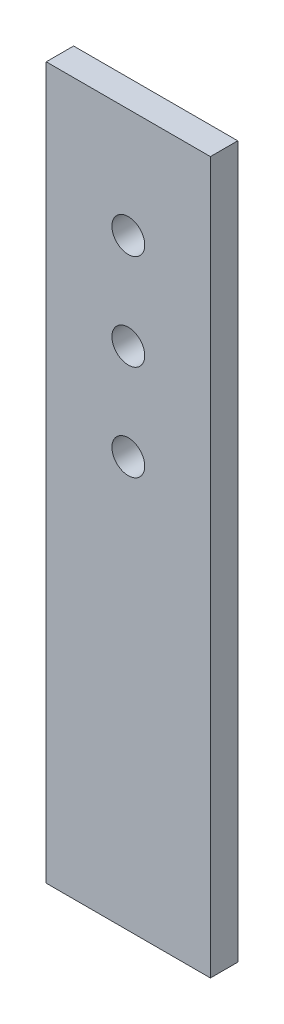
ISO-10303-21;
HEADER;
FILE_DESCRIPTION(('STEP AP214'),'2;1');
FILE_NAME('part.step','',(''),(''),'','','');
FILE_SCHEMA(('AUTOMOTIVE_DESIGN { 1 0 10303 214 1 1 1 1 }'));
ENDSEC;
DATA;
#1=APPLICATION_CONTEXT('core data for automotive mechanical design processes');
#2=APPLICATION_PROTOCOL_DEFINITION('international standard','automotive_design',2000,#1);
#3=PRODUCT_CONTEXT('',#1,'mechanical');
#4=PRODUCT('Part','Part','',(#3));
#5=PRODUCT_RELATED_PRODUCT_CATEGORY('part','',(#4));
#6=PRODUCT_DEFINITION_FORMATION('','',#4);
#7=PRODUCT_DEFINITION_CONTEXT('part definition',#1,'design');
#8=PRODUCT_DEFINITION('design','',#6,#7);
#9=PRODUCT_DEFINITION_SHAPE('','',#8);
#10=(LENGTH_UNIT() NAMED_UNIT(*) SI_UNIT(.MILLI.,.METRE.));
#11=(NAMED_UNIT(*) PLANE_ANGLE_UNIT() SI_UNIT($,.RADIAN.));
#12=(NAMED_UNIT(*) SI_UNIT($,.STERADIAN.) SOLID_ANGLE_UNIT());
#13=UNCERTAINTY_MEASURE_WITH_UNIT(LENGTH_MEASURE(1.E-05),#10,'distance_accuracy_value','');
#14=(GEOMETRIC_REPRESENTATION_CONTEXT(3) GLOBAL_UNCERTAINTY_ASSIGNED_CONTEXT((#13)) GLOBAL_UNIT_ASSIGNED_CONTEXT((#10,
#11,#12)) REPRESENTATION_CONTEXT('',''));
#15=CARTESIAN_POINT('',(0.,0.,0.));
#16=DIRECTION('',(0.,0.,1.));
#17=DIRECTION('',(1.,0.,0.));
#18=AXIS2_PLACEMENT_3D('',#15,#16,#17);
#19=CARTESIAN_POINT('',(0.,0.,10.));
#20=DIRECTION('',(0.,0.,1.));
#21=DIRECTION('',(1.,0.,0.));
#22=AXIS2_PLACEMENT_3D('',#19,#20,#21);
#23=PLANE('',#22);
#24=CARTESIAN_POINT('',(0.,89.9999999999999,10.));
#25=DIRECTION('',(0.,0.,1.));
#26=DIRECTION('',(1.,0.,0.));
#27=AXIS2_PLACEMENT_3D('',#24,#25,#26);
#28=CIRCLE('',#27,6.00000000000001);
#29=CARTESIAN_POINT('',(6.00000000000001,89.9999999999999,10.));
#30=VERTEX_POINT('',#29);
#31=EDGE_CURVE('E116',#30,#30,#28,.T.);
#32=ORIENTED_EDGE('',*,*,#31,.F.);
#33=EDGE_LOOP('',(#32));
#34=FACE_BOUND('',#33,.T.);
#35=DIRECTION('',(0.,1.,0.));
#36=VECTOR('',#35,1.);
#37=CARTESIAN_POINT('',(29.9999999999999,130.,10.));
#38=LINE('',#37,#36);
#39=CARTESIAN_POINT('',(30.,-130.,10.));
#40=VERTEX_POINT('',#39);
#41=CARTESIAN_POINT('',(29.9999999999999,130.,10.));
#42=VERTEX_POINT('',#41);
#43=EDGE_CURVE('E86',#40,#42,#38,.T.);
#44=ORIENTED_EDGE('',*,*,#43,.T.);
#45=DIRECTION('',(-1.,0.,0.));
#46=VECTOR('',#45,1.);
#47=CARTESIAN_POINT('',(-29.9999999999999,130.,10.));
#48=LINE('',#47,#46);
#49=CARTESIAN_POINT('',(-29.9999999999999,130.,10.));
#50=VERTEX_POINT('',#49);
#51=EDGE_CURVE('E81',#42,#50,#48,.T.);
#52=ORIENTED_EDGE('',*,*,#51,.T.);
#53=DIRECTION('',(0.,-1.,0.));
#54=VECTOR('',#53,1.);
#55=CARTESIAN_POINT('',(-29.9999999999999,130.,10.));
#56=LINE('',#55,#54);
#57=CARTESIAN_POINT('',(-30.,-130.,10.));
#58=VERTEX_POINT('',#57);
#59=EDGE_CURVE('E84',#50,#58,#56,.T.);
#60=ORIENTED_EDGE('',*,*,#59,.T.);
#61=DIRECTION('',(1.,0.,0.));
#62=VECTOR('',#61,1.);
#63=CARTESIAN_POINT('',(-30.,-130.,10.));
#64=LINE('',#63,#62);
#65=EDGE_CURVE('E51',#58,#40,#64,.T.);
#66=ORIENTED_EDGE('',*,*,#65,.T.);
#67=EDGE_LOOP('',(#44,#52,#60,#66));
#68=FACE_BOUND('',#67,.T.);
#69=CARTESIAN_POINT('',(0.,54.9999999999999,10.));
#70=DIRECTION('',(0.,0.,1.));
#71=DIRECTION('',(1.,0.,0.));
#72=AXIS2_PLACEMENT_3D('',#69,#70,#71);
#73=CIRCLE('',#72,6.);
#74=CARTESIAN_POINT('',(6.00000000000001,54.9999999999999,10.));
#75=VERTEX_POINT('',#74);
#76=EDGE_CURVE('E101',#75,#75,#73,.T.);
#77=ORIENTED_EDGE('',*,*,#76,.F.);
#78=EDGE_LOOP('',(#77));
#79=FACE_BOUND('',#78,.T.);
#80=CARTESIAN_POINT('',(0.,19.9999999999999,10.));
#81=DIRECTION('',(0.,0.,1.));
#82=DIRECTION('',(1.,0.,0.));
#83=AXIS2_PLACEMENT_3D('',#80,#81,#82);
#84=CIRCLE('',#83,6.);
#85=CARTESIAN_POINT('',(6.00000000000002,19.9999999999999,10.));
#86=VERTEX_POINT('',#85);
#87=EDGE_CURVE('E122',#86,#86,#84,.T.);
#88=ORIENTED_EDGE('',*,*,#87,.F.);
#89=EDGE_LOOP('',(#88));
#90=FACE_BOUND('',#89,.T.);
#91=ADVANCED_FACE('F34',(#34,#68,#79,#90),#23,.T.);
#92=CARTESIAN_POINT('',(0.,0.,0.));
#93=DIRECTION('',(0.,0.,1.));
#94=DIRECTION('',(1.,0.,0.));
#95=AXIS2_PLACEMENT_3D('',#92,#93,#94);
#96=PLANE('',#95);
#97=DIRECTION('',(0.,1.,0.));
#98=VECTOR('',#97,1.);
#99=CARTESIAN_POINT('',(29.9999999999999,130.,0.));
#100=LINE('',#99,#98);
#101=CARTESIAN_POINT('',(30.,-130.,0.));
#102=VERTEX_POINT('',#101);
#103=CARTESIAN_POINT('',(29.9999999999999,130.,0.));
#104=VERTEX_POINT('',#103);
#105=EDGE_CURVE('E98',#102,#104,#100,.T.);
#106=ORIENTED_EDGE('',*,*,#105,.F.);
#107=DIRECTION('',(1.,0.,0.));
#108=VECTOR('',#107,1.);
#109=CARTESIAN_POINT('',(-30.,-130.,0.));
#110=LINE('',#109,#108);
#111=CARTESIAN_POINT('',(-30.,-130.,0.));
#112=VERTEX_POINT('',#111);
#113=EDGE_CURVE('E74',#112,#102,#110,.T.);
#114=ORIENTED_EDGE('',*,*,#113,.F.);
#115=DIRECTION('',(0.,-1.,0.));
#116=VECTOR('',#115,1.);
#117=CARTESIAN_POINT('',(-29.9999999999999,130.,0.));
#118=LINE('',#117,#116);
#119=CARTESIAN_POINT('',(-29.9999999999999,130.,0.));
#120=VERTEX_POINT('',#119);
#121=EDGE_CURVE('E68',#120,#112,#118,.T.);
#122=ORIENTED_EDGE('',*,*,#121,.F.);
#123=DIRECTION('',(-1.,0.,0.));
#124=VECTOR('',#123,1.);
#125=CARTESIAN_POINT('',(-29.9999999999999,130.,0.));
#126=LINE('',#125,#124);
#127=EDGE_CURVE('E90',#104,#120,#126,.T.);
#128=ORIENTED_EDGE('',*,*,#127,.F.);
#129=EDGE_LOOP('',(#106,#114,#122,#128));
#130=FACE_BOUND('',#129,.T.);
#131=CARTESIAN_POINT('',(0.,54.9999999999999,0.));
#132=DIRECTION('',(0.,0.,1.));
#133=DIRECTION('',(1.,0.,0.));
#134=AXIS2_PLACEMENT_3D('',#131,#132,#133);
#135=CIRCLE('',#134,6.);
#136=CARTESIAN_POINT('',(6.00000000000001,54.9999999999999,0.));
#137=VERTEX_POINT('',#136);
#138=EDGE_CURVE('E113',#137,#137,#135,.T.);
#139=ORIENTED_EDGE('',*,*,#138,.T.);
#140=EDGE_LOOP('',(#139));
#141=FACE_BOUND('',#140,.T.);
#142=CARTESIAN_POINT('',(0.,89.9999999999999,0.));
#143=DIRECTION('',(0.,0.,1.));
#144=DIRECTION('',(1.,0.,0.));
#145=AXIS2_PLACEMENT_3D('',#142,#143,#144);
#146=CIRCLE('',#145,6.00000000000001);
#147=CARTESIAN_POINT('',(6.00000000000001,89.9999999999999,0.));
#148=VERTEX_POINT('',#147);
#149=EDGE_CURVE('E119',#148,#148,#146,.T.);
#150=ORIENTED_EDGE('',*,*,#149,.T.);
#151=EDGE_LOOP('',(#150));
#152=FACE_BOUND('',#151,.T.);
#153=CARTESIAN_POINT('',(0.,19.9999999999999,0.));
#154=DIRECTION('',(0.,0.,1.));
#155=DIRECTION('',(1.,0.,0.));
#156=AXIS2_PLACEMENT_3D('',#153,#154,#155);
#157=CIRCLE('',#156,6.);
#158=CARTESIAN_POINT('',(6.00000000000002,19.9999999999999,0.));
#159=VERTEX_POINT('',#158);
#160=EDGE_CURVE('E125',#159,#159,#157,.T.);
#161=ORIENTED_EDGE('',*,*,#160,.T.);
#162=EDGE_LOOP('',(#161));
#163=FACE_BOUND('',#162,.T.);
#164=ADVANCED_FACE('F109',(#130,#141,#152,#163),#96,.F.);
#165=CARTESIAN_POINT('',(29.9999999999999,130.,10.));
#166=DIRECTION('',(-1.,0.,0.));
#167=DIRECTION('',(0.,-1.,0.));
#168=AXIS2_PLACEMENT_3D('',#165,#166,#167);
#169=PLANE('',#168);
#170=ORIENTED_EDGE('',*,*,#105,.T.);
#171=DIRECTION('',(0.,0.,-1.));
#172=VECTOR('',#171,1.);
#173=CARTESIAN_POINT('',(29.9999999999999,130.,10.));
#174=LINE('',#173,#172);
#175=EDGE_CURVE('E11',#42,#104,#174,.T.);
#176=ORIENTED_EDGE('',*,*,#175,.F.);
#177=ORIENTED_EDGE('',*,*,#43,.F.);
#178=DIRECTION('',(0.,0.,-1.));
#179=VECTOR('',#178,1.);
#180=CARTESIAN_POINT('',(30.,-130.,10.));
#181=LINE('',#180,#179);
#182=EDGE_CURVE('E94',#40,#102,#181,.T.);
#183=ORIENTED_EDGE('',*,*,#182,.T.);
#184=EDGE_LOOP('',(#170,#176,#177,#183));
#185=FACE_BOUND('',#184,.T.);
#186=ADVANCED_FACE('F36',(#185),#169,.F.);
#187=CARTESIAN_POINT('',(-29.9999999999999,130.,10.));
#188=DIRECTION('',(0.,-1.,0.));
#189=DIRECTION('',(0.,0.,-1.));
#190=AXIS2_PLACEMENT_3D('',#187,#188,#189);
#191=PLANE('',#190);
#192=ORIENTED_EDGE('',*,*,#127,.T.);
#193=DIRECTION('',(0.,0.,-1.));
#194=VECTOR('',#193,1.);
#195=CARTESIAN_POINT('',(-29.9999999999999,130.,10.));
#196=LINE('',#195,#194);
#197=EDGE_CURVE('E43',#50,#120,#196,.T.);
#198=ORIENTED_EDGE('',*,*,#197,.F.);
#199=ORIENTED_EDGE('',*,*,#51,.F.);
#200=ORIENTED_EDGE('',*,*,#175,.T.);
#201=EDGE_LOOP('',(#192,#198,#199,#200));
#202=FACE_BOUND('',#201,.T.);
#203=ADVANCED_FACE('F89',(#202),#191,.F.);
#204=CARTESIAN_POINT('',(-29.9999999999999,130.,10.));
#205=DIRECTION('',(1.,0.,0.));
#206=DIRECTION('',(0.,1.,0.));
#207=AXIS2_PLACEMENT_3D('',#204,#205,#206);
#208=PLANE('',#207);
#209=ORIENTED_EDGE('',*,*,#121,.T.);
#210=DIRECTION('',(0.,0.,-1.));
#211=VECTOR('',#210,1.);
#212=CARTESIAN_POINT('',(-30.,-130.,10.));
#213=LINE('',#212,#211);
#214=EDGE_CURVE('E91',#58,#112,#213,.T.);
#215=ORIENTED_EDGE('',*,*,#214,.F.);
#216=ORIENTED_EDGE('',*,*,#59,.F.);
#217=ORIENTED_EDGE('',*,*,#197,.T.);
#218=EDGE_LOOP('',(#209,#215,#216,#217));
#219=FACE_BOUND('',#218,.T.);
#220=ADVANCED_FACE('F92',(#219),#208,.F.);
#221=CARTESIAN_POINT('',(-30.,-130.,10.));
#222=DIRECTION('',(0.,1.,0.));
#223=DIRECTION('',(-1.,0.,0.));
#224=AXIS2_PLACEMENT_3D('',#221,#222,#223);
#225=PLANE('',#224);
#226=ORIENTED_EDGE('',*,*,#113,.T.);
#227=ORIENTED_EDGE('',*,*,#182,.F.);
#228=ORIENTED_EDGE('',*,*,#65,.F.);
#229=ORIENTED_EDGE('',*,*,#214,.T.);
#230=EDGE_LOOP('',(#226,#227,#228,#229));
#231=FACE_BOUND('',#230,.T.);
#232=ADVANCED_FACE('F106',(#231),#225,.F.);
#233=CARTESIAN_POINT('',(0.,54.9999999999999,10.));
#234=DIRECTION('',(0.,0.,-1.));
#235=DIRECTION('',(-1.,0.,0.));
#236=AXIS2_PLACEMENT_3D('',#233,#234,#235);
#237=CYLINDRICAL_SURFACE('',#236,6.);
#238=ORIENTED_EDGE('',*,*,#76,.T.);
#239=EDGE_LOOP('',(#238));
#240=FACE_BOUND('',#239,.T.);
#241=ORIENTED_EDGE('',*,*,#138,.F.);
#242=EDGE_LOOP('',(#241));
#243=FACE_BOUND('',#242,.T.);
#244=ADVANCED_FACE('F143',(#240,#243),#237,.F.);
#245=CARTESIAN_POINT('',(0.,89.9999999999999,10.));
#246=DIRECTION('',(0.,0.,-1.));
#247=DIRECTION('',(-1.,0.,0.));
#248=AXIS2_PLACEMENT_3D('',#245,#246,#247);
#249=CYLINDRICAL_SURFACE('',#248,6.00000000000001);
#250=ORIENTED_EDGE('',*,*,#31,.T.);
#251=EDGE_LOOP('',(#250));
#252=FACE_BOUND('',#251,.T.);
#253=ORIENTED_EDGE('',*,*,#149,.F.);
#254=EDGE_LOOP('',(#253));
#255=FACE_BOUND('',#254,.T.);
#256=ADVANCED_FACE('F189',(#252,#255),#249,.F.);
#257=CARTESIAN_POINT('',(0.,19.9999999999999,10.));
#258=DIRECTION('',(0.,0.,-1.));
#259=DIRECTION('',(-1.,0.,0.));
#260=AXIS2_PLACEMENT_3D('',#257,#258,#259);
#261=CYLINDRICAL_SURFACE('',#260,6.);
#262=ORIENTED_EDGE('',*,*,#87,.T.);
#263=EDGE_LOOP('',(#262));
#264=FACE_BOUND('',#263,.T.);
#265=ORIENTED_EDGE('',*,*,#160,.F.);
#266=EDGE_LOOP('',(#265));
#267=FACE_BOUND('',#266,.T.);
#268=ADVANCED_FACE('F131',(#264,#267),#261,.F.);
#269=CLOSED_SHELL('',(#91,#164,#186,#203,#220,#232,#244,#256,#268));
#270=MANIFOLD_SOLID_BREP('B2',#269);
#271=ADVANCED_BREP_SHAPE_REPRESENTATION('',(#18,#270),#14);
#272=SHAPE_DEFINITION_REPRESENTATION(#9,#271);
ENDSEC;
END-ISO-10303-21;
